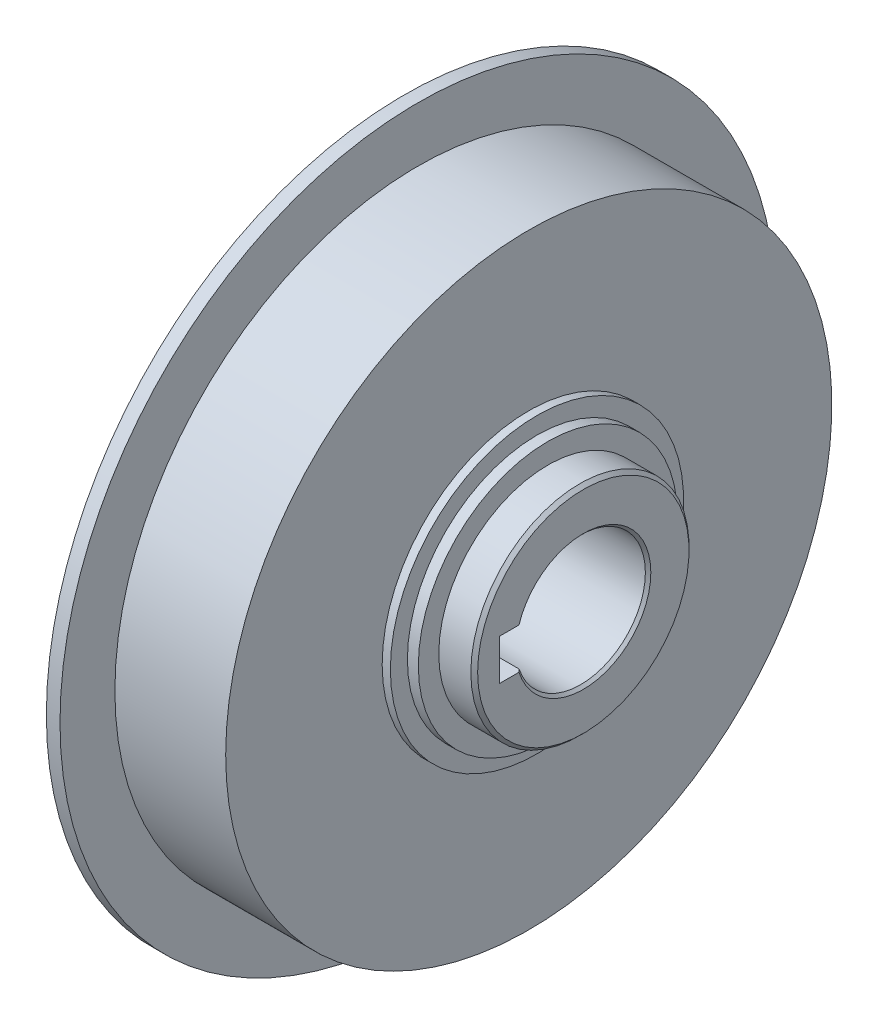
ISO-10303-21;
HEADER;
FILE_DESCRIPTION(('STEP AP214'),'2;1');
FILE_NAME('part.step','',(''),(''),'','','');
FILE_SCHEMA(('AUTOMOTIVE_DESIGN { 1 0 10303 214 1 1 1 1 }'));
ENDSEC;
DATA;
#1=APPLICATION_CONTEXT('core data for automotive mechanical design processes');
#2=APPLICATION_PROTOCOL_DEFINITION('international standard','automotive_design',2000,#1);
#3=PRODUCT_CONTEXT('',#1,'mechanical');
#4=PRODUCT('Part','Part','',(#3));
#5=PRODUCT_RELATED_PRODUCT_CATEGORY('part','',(#4));
#6=PRODUCT_DEFINITION_FORMATION('','',#4);
#7=PRODUCT_DEFINITION_CONTEXT('part definition',#1,'design');
#8=PRODUCT_DEFINITION('design','',#6,#7);
#9=PRODUCT_DEFINITION_SHAPE('','',#8);
#10=(LENGTH_UNIT() NAMED_UNIT(*) SI_UNIT(.MILLI.,.METRE.));
#11=(NAMED_UNIT(*) PLANE_ANGLE_UNIT() SI_UNIT($,.RADIAN.));
#12=(NAMED_UNIT(*) SI_UNIT($,.STERADIAN.) SOLID_ANGLE_UNIT());
#13=UNCERTAINTY_MEASURE_WITH_UNIT(LENGTH_MEASURE(1.E-05),#10,'distance_accuracy_value','');
#14=(GEOMETRIC_REPRESENTATION_CONTEXT(3) GLOBAL_UNCERTAINTY_ASSIGNED_CONTEXT((#13)) GLOBAL_UNIT_ASSIGNED_CONTEXT((#10,
#11,#12)) REPRESENTATION_CONTEXT('',''));
#15=CARTESIAN_POINT('',(0.,0.,0.));
#16=DIRECTION('',(0.,0.,1.));
#17=DIRECTION('',(1.,0.,0.));
#18=AXIS2_PLACEMENT_3D('',#15,#16,#17);
#19=CARTESIAN_POINT('',(64.1,0.,0.));
#20=DIRECTION('',(1.,0.,0.));
#21=DIRECTION('',(0.,0.,-1.));
#22=AXIS2_PLACEMENT_3D('',#19,#20,#21);
#23=CONICAL_SURFACE('',#22,9.89999999999999,0.785398163397453);
#24=CARTESIAN_POINT('',(63.7,0.,0.));
#25=DIRECTION('',(-1.,0.,0.));
#26=DIRECTION('',(0.,0.,1.));
#27=AXIS2_PLACEMENT_3D('',#24,#25,#26);
#28=CIRCLE('',#27,9.5);
#29=CARTESIAN_POINT('',(63.7,3.,9.01387818865997));
#30=VERTEX_POINT('',#29);
#31=CARTESIAN_POINT('',(63.7,-3.,9.01387818865997));
#32=VERTEX_POINT('',#31);
#33=EDGE_CURVE('E80',#30,#32,#28,.T.);
#34=ORIENTED_EDGE('',*,*,#33,.T.);
#35=CARTESIAN_POINT('',(64.1,-3.,9.43451111610983));
#36=CARTESIAN_POINT('',(64.0332569464257,-3.,9.36447826898815));
#37=CARTESIAN_POINT('',(63.9665520865089,-3.,9.29440910168789));
#38=CARTESIAN_POINT('',(63.8332187531747,-3.,9.15419812587216));
#39=CARTESIAN_POINT('',(63.7665902797581,-3.,9.0840563173558));
#40=CARTESIAN_POINT('',(63.7,-3.,9.01387818865998));
#41=B_SPLINE_CURVE_WITH_KNOTS('',3,(#35,#36,#37,#38,#39,#40),.UNSPECIFIED.,.F.,.F.,(4,2,4),(0.,
0.290229286744041,0.58045857704044),.UNSPECIFIED.);
#42=CARTESIAN_POINT('',(64.1,-3.,9.43451111610983));
#43=VERTEX_POINT('',#42);
#44=EDGE_CURVE('E75',#43,#32,#41,.T.);
#45=ORIENTED_EDGE('',*,*,#44,.F.);
#46=CARTESIAN_POINT('',(64.1,0.,0.));
#47=DIRECTION('',(1.,0.,0.));
#48=DIRECTION('',(0.,0.,-1.));
#49=AXIS2_PLACEMENT_3D('',#46,#47,#48);
#50=CIRCLE('',#49,9.89999999999999);
#51=CARTESIAN_POINT('',(64.1,3.,9.43451111610983));
#52=VERTEX_POINT('',#51);
#53=EDGE_CURVE('E73',#52,#43,#50,.F.);
#54=ORIENTED_EDGE('',*,*,#53,.F.);
#55=CARTESIAN_POINT('',(63.7,3.,9.01387818865998));
#56=CARTESIAN_POINT('',(63.7665902797581,3.,9.0840563173558));
#57=CARTESIAN_POINT('',(63.8332187531747,3.,9.15419812587216));
#58=CARTESIAN_POINT('',(63.9665520865089,3.,9.29440910168789));
#59=CARTESIAN_POINT('',(64.0332569464257,3.,9.36447826898815));
#60=CARTESIAN_POINT('',(64.1,3.,9.43451111610983));
#61=B_SPLINE_CURVE_WITH_KNOTS('',3,(#55,#56,#57,#58,#59,#60),.UNSPECIFIED.,.F.,.F.,(4,2,4),(0.,
0.290229290296408,0.580458577040441),.UNSPECIFIED.);
#62=EDGE_CURVE('E21',#30,#52,#61,.T.);
#63=ORIENTED_EDGE('',*,*,#62,.F.);
#64=EDGE_LOOP('',(#34,#45,#54,#63));
#65=FACE_BOUND('',#64,.T.);
#66=ADVANCED_FACE('F17',(#65),#23,.F.);
#67=CARTESIAN_POINT('',(46.7,0.,0.));
#68=DIRECTION('',(-1.,0.,0.));
#69=DIRECTION('',(0.,0.,1.));
#70=AXIS2_PLACEMENT_3D('',#67,#68,#69);
#71=CYLINDRICAL_SURFACE('',#70,9.5);
#72=ORIENTED_EDGE('',*,*,#33,.F.);
#73=DIRECTION('',(1.,0.,0.));
#74=VECTOR('',#73,1.);
#75=CARTESIAN_POINT('',(46.7,3.,9.01387818865997));
#76=LINE('',#75,#74);
#77=CARTESIAN_POINT('',(29.7,3.,9.01387818865997));
#78=VERTEX_POINT('',#77);
#79=EDGE_CURVE('E88',#78,#30,#76,.T.);
#80=ORIENTED_EDGE('',*,*,#79,.F.);
#81=CARTESIAN_POINT('',(29.7,0.,0.));
#82=DIRECTION('',(-1.,0.,0.));
#83=DIRECTION('',(0.,0.,1.));
#84=AXIS2_PLACEMENT_3D('',#81,#82,#83);
#85=CIRCLE('',#84,9.5);
#86=CARTESIAN_POINT('',(29.7,-3.,9.01387818865997));
#87=VERTEX_POINT('',#86);
#88=EDGE_CURVE('E94',#78,#87,#85,.T.);
#89=ORIENTED_EDGE('',*,*,#88,.T.);
#90=DIRECTION('',(1.,0.,0.));
#91=VECTOR('',#90,1.);
#92=CARTESIAN_POINT('',(46.7,-3.,9.01387818865997));
#93=LINE('',#92,#91);
#94=EDGE_CURVE('E79',#32,#87,#93,.F.);
#95=ORIENTED_EDGE('',*,*,#94,.F.);
#96=EDGE_LOOP('',(#72,#80,#89,#95));
#97=FACE_BOUND('',#96,.T.);
#98=ADVANCED_FACE('F308',(#97),#71,.F.);
#99=CARTESIAN_POINT('',(64.1,0.,12.7));
#100=DIRECTION('',(1.,0.,0.));
#101=DIRECTION('',(0.,0.,-1.));
#102=AXIS2_PLACEMENT_3D('',#99,#100,#101);
#103=PLANE('',#102);
#104=DIRECTION('',(0.,0.,-1.));
#105=VECTOR('',#104,1.);
#106=CARTESIAN_POINT('',(64.1,3.,6.15));
#107=LINE('',#106,#105);
#108=CARTESIAN_POINT('',(64.1,3.,12.3));
#109=VERTEX_POINT('',#108);
#110=EDGE_CURVE('E85',#52,#109,#107,.F.);
#111=ORIENTED_EDGE('',*,*,#110,.F.);
#112=ORIENTED_EDGE('',*,*,#53,.T.);
#113=DIRECTION('',(0.,0.,1.));
#114=VECTOR('',#113,1.);
#115=CARTESIAN_POINT('',(64.1,-3.,6.15));
#116=LINE('',#115,#114);
#117=CARTESIAN_POINT('',(64.1,-3.,12.3));
#118=VERTEX_POINT('',#117);
#119=EDGE_CURVE('E110',#118,#43,#116,.F.);
#120=ORIENTED_EDGE('',*,*,#119,.F.);
#121=DIRECTION('',(0.,1.,0.));
#122=VECTOR('',#121,1.);
#123=CARTESIAN_POINT('',(64.1,0.,12.3));
#124=LINE('',#123,#122);
#125=EDGE_CURVE('E92',#118,#109,#124,.T.);
#126=ORIENTED_EDGE('',*,*,#125,.T.);
#127=EDGE_LOOP('',(#111,#112,#120,#126));
#128=FACE_BOUND('',#127,.T.);
#129=CARTESIAN_POINT('',(64.1,0.,0.));
#130=DIRECTION('',(-1.,0.,0.));
#131=DIRECTION('',(0.,0.,1.));
#132=AXIS2_PLACEMENT_3D('',#129,#130,#131);
#133=CIRCLE('',#132,15.5);
#134=CARTESIAN_POINT('',(64.1,0.,15.5));
#135=VERTEX_POINT('',#134);
#136=EDGE_CURVE('E149',#135,#135,#133,.T.);
#137=ORIENTED_EDGE('',*,*,#136,.F.);
#138=EDGE_LOOP('',(#137));
#139=FACE_BOUND('',#138,.T.);
#140=ADVANCED_FACE('F89',(#128,#139),#103,.T.);
#141=CARTESIAN_POINT('',(46.7,-3.,6.15));
#142=DIRECTION('',(0.,1.,0.));
#143=DIRECTION('',(0.,0.,1.));
#144=AXIS2_PLACEMENT_3D('',#141,#142,#143);
#145=PLANE('',#144);
#146=DIRECTION('',(1.,0.,0.));
#147=VECTOR('',#146,1.);
#148=CARTESIAN_POINT('',(46.7,-3.,12.3));
#149=LINE('',#148,#147);
#150=CARTESIAN_POINT('',(29.3,-3.,12.3));
#151=VERTEX_POINT('',#150);
#152=EDGE_CURVE('E384',#151,#118,#149,.T.);
#153=ORIENTED_EDGE('',*,*,#152,.T.);
#154=ORIENTED_EDGE('',*,*,#119,.T.);
#155=ORIENTED_EDGE('',*,*,#44,.T.);
#156=ORIENTED_EDGE('',*,*,#94,.T.);
#157=CARTESIAN_POINT('',(29.7,-3.,9.01387818865997));
#158=CARTESIAN_POINT('',(29.6334097202419,-3.,9.0840563173558));
#159=CARTESIAN_POINT('',(29.5667812468253,-3.,9.15419812587216));
#160=CARTESIAN_POINT('',(29.4334479134911,-3.,9.29440910168789));
#161=CARTESIAN_POINT('',(29.3667430535743,-3.,9.36447826898815));
#162=CARTESIAN_POINT('',(29.3,-3.,9.43451111610984));
#163=B_SPLINE_CURVE_WITH_KNOTS('',3,(#157,#158,#159,#160,#161,#162),.UNSPECIFIED.,.F.,.F.,(4,2,
4),(0.,0.290229290296411,0.580458577040461),.UNSPECIFIED.);
#164=CARTESIAN_POINT('',(29.3,-3.,9.43451111610983));
#165=VERTEX_POINT('',#164);
#166=EDGE_CURVE('E97',#87,#165,#163,.T.);
#167=ORIENTED_EDGE('',*,*,#166,.T.);
#168=DIRECTION('',(0.,0.,1.));
#169=VECTOR('',#168,1.);
#170=CARTESIAN_POINT('',(29.3,-3.,24.325));
#171=LINE('',#170,#169);
#172=EDGE_CURVE('E148',#151,#165,#171,.F.);
#173=ORIENTED_EDGE('',*,*,#172,.F.);
#174=EDGE_LOOP('',(#153,#154,#155,#156,#167,#173));
#175=FACE_BOUND('',#174,.T.);
#176=ADVANCED_FACE('F295',(#175),#145,.T.);
#177=CARTESIAN_POINT('',(29.3,0.,0.));
#178=DIRECTION('',(-1.,0.,0.));
#179=DIRECTION('',(0.,-1.,0.));
#180=AXIS2_PLACEMENT_3D('',#177,#178,#179);
#181=CONICAL_SURFACE('',#180,9.90000000000001,0.78539816339745);
#182=ORIENTED_EDGE('',*,*,#88,.F.);
#183=CARTESIAN_POINT('',(29.3,3.,9.43451111610984));
#184=CARTESIAN_POINT('',(29.3667430535743,3.,9.36447826898815));
#185=CARTESIAN_POINT('',(29.4334479134911,3.,9.29440910168789));
#186=CARTESIAN_POINT('',(29.5667812468253,3.,9.15419812587216));
#187=CARTESIAN_POINT('',(29.6334097202419,3.,9.08405631735579));
#188=CARTESIAN_POINT('',(29.7,3.,9.01387818865997));
#189=B_SPLINE_CURVE_WITH_KNOTS('',3,(#183,#184,#185,#186,#187,#188),.UNSPECIFIED.,.F.,.F.,(4,2,
4),(0.,0.290229286744052,0.580458577040469),.UNSPECIFIED.);
#190=CARTESIAN_POINT('',(29.3,3.,9.43451111610984));
#191=VERTEX_POINT('',#190);
#192=EDGE_CURVE('E93',#191,#78,#189,.T.);
#193=ORIENTED_EDGE('',*,*,#192,.F.);
#194=CARTESIAN_POINT('',(29.3,0.,0.));
#195=DIRECTION('',(-1.,0.,0.));
#196=DIRECTION('',(0.,-1.,0.));
#197=AXIS2_PLACEMENT_3D('',#194,#195,#196);
#198=CIRCLE('',#197,9.9);
#199=EDGE_CURVE('E144',#165,#191,#198,.F.);
#200=ORIENTED_EDGE('',*,*,#199,.F.);
#201=ORIENTED_EDGE('',*,*,#166,.F.);
#202=EDGE_LOOP('',(#182,#193,#200,#201));
#203=FACE_BOUND('',#202,.T.);
#204=ADVANCED_FACE('F160',(#203),#181,.F.);
#205=CARTESIAN_POINT('',(46.7,3.,6.15));
#206=DIRECTION('',(0.,-1.,0.));
#207=DIRECTION('',(0.,0.,-1.));
#208=AXIS2_PLACEMENT_3D('',#205,#206,#207);
#209=PLANE('',#208);
#210=ORIENTED_EDGE('',*,*,#192,.T.);
#211=ORIENTED_EDGE('',*,*,#79,.T.);
#212=ORIENTED_EDGE('',*,*,#62,.T.);
#213=ORIENTED_EDGE('',*,*,#110,.T.);
#214=DIRECTION('',(1.,0.,0.));
#215=VECTOR('',#214,1.);
#216=CARTESIAN_POINT('',(46.7,3.,12.3));
#217=LINE('',#216,#215);
#218=CARTESIAN_POINT('',(29.3,3.,12.3));
#219=VERTEX_POINT('',#218);
#220=EDGE_CURVE('E40',#109,#219,#217,.F.);
#221=ORIENTED_EDGE('',*,*,#220,.T.);
#222=DIRECTION('',(0.,0.,1.));
#223=VECTOR('',#222,1.);
#224=CARTESIAN_POINT('',(29.3,3.,24.325));
#225=LINE('',#224,#223);
#226=EDGE_CURVE('E147',#191,#219,#225,.T.);
#227=ORIENTED_EDGE('',*,*,#226,.F.);
#228=EDGE_LOOP('',(#210,#211,#212,#213,#221,#227));
#229=FACE_BOUND('',#228,.T.);
#230=ADVANCED_FACE('F84',(#229),#209,.T.);
#231=CARTESIAN_POINT('',(46.7,0.,12.3));
#232=DIRECTION('',(0.,0.,1.));
#233=DIRECTION('',(1.,0.,0.));
#234=AXIS2_PLACEMENT_3D('',#231,#232,#233);
#235=PLANE('',#234);
#236=ORIENTED_EDGE('',*,*,#152,.F.);
#237=DIRECTION('',(0.,1.,0.));
#238=VECTOR('',#237,1.);
#239=CARTESIAN_POINT('',(29.3,0.,12.3));
#240=LINE('',#239,#238);
#241=EDGE_CURVE('E392',#219,#151,#240,.F.);
#242=ORIENTED_EDGE('',*,*,#241,.F.);
#243=ORIENTED_EDGE('',*,*,#220,.F.);
#244=ORIENTED_EDGE('',*,*,#125,.F.);
#245=EDGE_LOOP('',(#236,#242,#243,#244));
#246=FACE_BOUND('',#245,.T.);
#247=ADVANCED_FACE('F165',(#246),#235,.F.);
#248=CARTESIAN_POINT('',(63.6,0.,0.));
#249=DIRECTION('',(-1.,0.,0.));
#250=DIRECTION('',(0.,0.,1.));
#251=AXIS2_PLACEMENT_3D('',#248,#249,#250);
#252=CONICAL_SURFACE('',#251,16.,0.785398163397448);
#253=ORIENTED_EDGE('',*,*,#136,.T.);
#254=EDGE_LOOP('',(#253));
#255=FACE_BOUND('',#254,.T.);
#256=CARTESIAN_POINT('',(63.6,0.,0.));
#257=DIRECTION('',(-1.,0.,0.));
#258=DIRECTION('',(0.,0.,1.));
#259=AXIS2_PLACEMENT_3D('',#256,#257,#258);
#260=CIRCLE('',#259,16.);
#261=CARTESIAN_POINT('',(63.6,0.,16.));
#262=VERTEX_POINT('',#261);
#263=EDGE_CURVE('E143',#262,#262,#260,.T.);
#264=ORIENTED_EDGE('',*,*,#263,.F.);
#265=EDGE_LOOP('',(#264));
#266=FACE_BOUND('',#265,.T.);
#267=ADVANCED_FACE('F169',(#255,#266),#252,.T.);
#268=CARTESIAN_POINT('',(29.3,0.,24.325));
#269=DIRECTION('',(-1.,0.,0.));
#270=DIRECTION('',(0.,0.,1.));
#271=AXIS2_PLACEMENT_3D('',#268,#269,#270);
#272=PLANE('',#271);
#273=CARTESIAN_POINT('',(29.3,0.,0.));
#274=DIRECTION('',(-1.,0.,0.));
#275=DIRECTION('',(0.,0.,1.));
#276=AXIS2_PLACEMENT_3D('',#273,#274,#275);
#277=CIRCLE('',#276,38.75);
#278=CARTESIAN_POINT('',(29.3,0.,38.75));
#279=VERTEX_POINT('',#278);
#280=EDGE_CURVE('E140',#279,#279,#277,.F.);
#281=ORIENTED_EDGE('',*,*,#280,.F.);
#282=EDGE_LOOP('',(#281));
#283=FACE_BOUND('',#282,.T.);
#284=ORIENTED_EDGE('',*,*,#226,.T.);
#285=ORIENTED_EDGE('',*,*,#241,.T.);
#286=ORIENTED_EDGE('',*,*,#172,.T.);
#287=ORIENTED_EDGE('',*,*,#199,.T.);
#288=EDGE_LOOP('',(#284,#285,#286,#287));
#289=FACE_BOUND('',#288,.T.);
#290=ADVANCED_FACE('F173',(#283,#289),#272,.T.);
#291=CARTESIAN_POINT('',(61.25,0.,0.));
#292=DIRECTION('',(-1.,0.,0.));
#293=DIRECTION('',(0.,0.,1.));
#294=AXIS2_PLACEMENT_3D('',#291,#292,#293);
#295=CYLINDRICAL_SURFACE('',#294,16.);
#296=ORIENTED_EDGE('',*,*,#263,.T.);
#297=EDGE_LOOP('',(#296));
#298=FACE_BOUND('',#297,.T.);
#299=CARTESIAN_POINT('',(58.9,0.,0.));
#300=DIRECTION('',(-1.,0.,0.));
#301=DIRECTION('',(0.,0.,1.));
#302=AXIS2_PLACEMENT_3D('',#299,#300,#301);
#303=CIRCLE('',#302,16.);
#304=CARTESIAN_POINT('',(58.9,0.,16.));
#305=VERTEX_POINT('',#304);
#306=EDGE_CURVE('E137',#305,#305,#303,.T.);
#307=ORIENTED_EDGE('',*,*,#306,.F.);
#308=EDGE_LOOP('',(#307));
#309=FACE_BOUND('',#308,.T.);
#310=ADVANCED_FACE('F177',(#298,#309),#295,.T.);
#311=CARTESIAN_POINT('',(33.575,0.,0.));
#312=DIRECTION('',(-1.,0.,0.));
#313=DIRECTION('',(0.,0.,1.));
#314=AXIS2_PLACEMENT_3D('',#311,#312,#313);
#315=CYLINDRICAL_SURFACE('',#314,38.75);
#316=CARTESIAN_POINT('',(37.85,0.,0.));
#317=DIRECTION('',(-1.,0.,0.));
#318=DIRECTION('',(0.,0.,1.));
#319=AXIS2_PLACEMENT_3D('',#316,#317,#318);
#320=CIRCLE('',#319,38.75);
#321=CARTESIAN_POINT('',(37.85,0.,38.75));
#322=VERTEX_POINT('',#321);
#323=EDGE_CURVE('E134',#322,#322,#320,.F.);
#324=ORIENTED_EDGE('',*,*,#323,.F.);
#325=EDGE_LOOP('',(#324));
#326=FACE_BOUND('',#325,.T.);
#327=ORIENTED_EDGE('',*,*,#280,.T.);
#328=EDGE_LOOP('',(#327));
#329=FACE_BOUND('',#328,.T.);
#330=ADVANCED_FACE('F181',(#326,#329),#315,.T.);
#331=CARTESIAN_POINT('',(58.9,0.,17.5));
#332=DIRECTION('',(1.,0.,0.));
#333=DIRECTION('',(0.,0.,-1.));
#334=AXIS2_PLACEMENT_3D('',#331,#332,#333);
#335=PLANE('',#334);
#336=CARTESIAN_POINT('',(58.9,0.,0.));
#337=DIRECTION('',(-1.,0.,0.));
#338=DIRECTION('',(0.,0.,1.));
#339=AXIS2_PLACEMENT_3D('',#336,#337,#338);
#340=CIRCLE('',#339,19.);
#341=CARTESIAN_POINT('',(58.9,0.,19.));
#342=VERTEX_POINT('',#341);
#343=EDGE_CURVE('E131',#342,#342,#340,.T.);
#344=ORIENTED_EDGE('',*,*,#343,.F.);
#345=EDGE_LOOP('',(#344));
#346=FACE_BOUND('',#345,.T.);
#347=ORIENTED_EDGE('',*,*,#306,.T.);
#348=EDGE_LOOP('',(#347));
#349=FACE_BOUND('',#348,.T.);
#350=ADVANCED_FACE('F185',(#346,#349),#335,.T.);
#351=CARTESIAN_POINT('',(37.85,0.,45.625));
#352=DIRECTION('',(-1.,0.,0.));
#353=DIRECTION('',(0.,0.,1.));
#354=AXIS2_PLACEMENT_3D('',#351,#352,#353);
#355=PLANE('',#354);
#356=ORIENTED_EDGE('',*,*,#323,.T.);
#357=EDGE_LOOP('',(#356));
#358=FACE_BOUND('',#357,.T.);
#359=CARTESIAN_POINT('',(37.85,0.,0.));
#360=DIRECTION('',(-1.,0.,0.));
#361=DIRECTION('',(0.,0.,1.));
#362=AXIS2_PLACEMENT_3D('',#359,#360,#361);
#363=CIRCLE('',#362,52.5);
#364=CARTESIAN_POINT('',(37.85,0.,52.5));
#365=VERTEX_POINT('',#364);
#366=EDGE_CURVE('E128',#365,#365,#363,.F.);
#367=ORIENTED_EDGE('',*,*,#366,.F.);
#368=EDGE_LOOP('',(#367));
#369=FACE_BOUND('',#368,.T.);
#370=ADVANCED_FACE('F189',(#358,#369),#355,.T.);
#371=CARTESIAN_POINT('',(58.1,0.,0.));
#372=DIRECTION('',(-1.,0.,0.));
#373=DIRECTION('',(0.,0.,1.));
#374=AXIS2_PLACEMENT_3D('',#371,#372,#373);
#375=CYLINDRICAL_SURFACE('',#374,19.);
#376=ORIENTED_EDGE('',*,*,#343,.T.);
#377=EDGE_LOOP('',(#376));
#378=FACE_BOUND('',#377,.T.);
#379=CARTESIAN_POINT('',(57.3,0.,0.));
#380=DIRECTION('',(-1.,0.,0.));
#381=DIRECTION('',(0.,0.,1.));
#382=AXIS2_PLACEMENT_3D('',#379,#380,#381);
#383=CIRCLE('',#382,19.);
#384=CARTESIAN_POINT('',(57.3,0.,19.));
#385=VERTEX_POINT('',#384);
#386=EDGE_CURVE('E125',#385,#385,#383,.T.);
#387=ORIENTED_EDGE('',*,*,#386,.F.);
#388=EDGE_LOOP('',(#387));
#389=FACE_BOUND('',#388,.T.);
#390=ADVANCED_FACE('F193',(#378,#389),#375,.T.);
#391=CARTESIAN_POINT('',(38.85,0.,0.));
#392=DIRECTION('',(-1.,0.,0.));
#393=DIRECTION('',(0.,0.,1.));
#394=AXIS2_PLACEMENT_3D('',#391,#392,#393);
#395=CYLINDRICAL_SURFACE('',#394,52.5);
#396=CARTESIAN_POINT('',(39.85,0.,0.));
#397=DIRECTION('',(-1.,0.,0.));
#398=DIRECTION('',(0.,0.,1.));
#399=AXIS2_PLACEMENT_3D('',#396,#397,#398);
#400=CIRCLE('',#399,52.5);
#401=CARTESIAN_POINT('',(39.85,0.,52.5));
#402=VERTEX_POINT('',#401);
#403=EDGE_CURVE('E122',#402,#402,#400,.F.);
#404=ORIENTED_EDGE('',*,*,#403,.F.);
#405=EDGE_LOOP('',(#404));
#406=FACE_BOUND('',#405,.T.);
#407=ORIENTED_EDGE('',*,*,#366,.T.);
#408=EDGE_LOOP('',(#407));
#409=FACE_BOUND('',#408,.T.);
#410=ADVANCED_FACE('F197',(#406,#409),#395,.T.);
#411=CARTESIAN_POINT('',(57.3,0.,20.25));
#412=DIRECTION('',(1.,0.,0.));
#413=DIRECTION('',(0.,0.,-1.));
#414=AXIS2_PLACEMENT_3D('',#411,#412,#413);
#415=PLANE('',#414);
#416=CARTESIAN_POINT('',(57.3,0.,0.));
#417=DIRECTION('',(-1.,0.,0.));
#418=DIRECTION('',(0.,0.,1.));
#419=AXIS2_PLACEMENT_3D('',#416,#417,#418);
#420=CIRCLE('',#419,21.5);
#421=CARTESIAN_POINT('',(57.3,0.,21.5));
#422=VERTEX_POINT('',#421);
#423=EDGE_CURVE('E119',#422,#422,#420,.T.);
#424=ORIENTED_EDGE('',*,*,#423,.F.);
#425=EDGE_LOOP('',(#424));
#426=FACE_BOUND('',#425,.T.);
#427=ORIENTED_EDGE('',*,*,#386,.T.);
#428=EDGE_LOOP('',(#427));
#429=FACE_BOUND('',#428,.T.);
#430=ADVANCED_FACE('F201',(#426,#429),#415,.T.);
#431=CARTESIAN_POINT('',(39.85,0.,48.475));
#432=DIRECTION('',(1.,0.,0.));
#433=DIRECTION('',(0.,0.,-1.));
#434=AXIS2_PLACEMENT_3D('',#431,#432,#433);
#435=PLANE('',#434);
#436=ORIENTED_EDGE('',*,*,#403,.T.);
#437=EDGE_LOOP('',(#436));
#438=FACE_BOUND('',#437,.T.);
#439=CARTESIAN_POINT('',(39.85,0.,0.));
#440=DIRECTION('',(-1.,0.,0.));
#441=DIRECTION('',(0.,0.,1.));
#442=AXIS2_PLACEMENT_3D('',#439,#440,#441);
#443=CIRCLE('',#442,44.45);
#444=CARTESIAN_POINT('',(39.85,0.,44.45));
#445=VERTEX_POINT('',#444);
#446=EDGE_CURVE('E116',#445,#445,#443,.F.);
#447=ORIENTED_EDGE('',*,*,#446,.F.);
#448=EDGE_LOOP('',(#447));
#449=FACE_BOUND('',#448,.T.);
#450=ADVANCED_FACE('F205',(#438,#449),#435,.T.);
#451=CARTESIAN_POINT('',(56.7,0.,0.));
#452=DIRECTION('',(-1.,0.,0.));
#453=DIRECTION('',(0.,0.,1.));
#454=AXIS2_PLACEMENT_3D('',#451,#452,#453);
#455=CYLINDRICAL_SURFACE('',#454,21.5);
#456=ORIENTED_EDGE('',*,*,#423,.T.);
#457=EDGE_LOOP('',(#456));
#458=FACE_BOUND('',#457,.T.);
#459=CARTESIAN_POINT('',(56.1,0.,0.));
#460=DIRECTION('',(-1.,0.,0.));
#461=DIRECTION('',(0.,0.,1.));
#462=AXIS2_PLACEMENT_3D('',#459,#460,#461);
#463=CIRCLE('',#462,21.5);
#464=CARTESIAN_POINT('',(56.1,0.,21.5));
#465=VERTEX_POINT('',#464);
#466=EDGE_CURVE('E31',#465,#465,#463,.T.);
#467=ORIENTED_EDGE('',*,*,#466,.F.);
#468=EDGE_LOOP('',(#467));
#469=FACE_BOUND('',#468,.T.);
#470=ADVANCED_FACE('F209',(#458,#469),#455,.T.);
#471=CARTESIAN_POINT('',(47.975,0.,0.));
#472=DIRECTION('',(-1.,0.,0.));
#473=DIRECTION('',(0.,0.,1.));
#474=AXIS2_PLACEMENT_3D('',#471,#472,#473);
#475=CYLINDRICAL_SURFACE('',#474,44.45);
#476=CARTESIAN_POINT('',(56.1,0.,0.));
#477=DIRECTION('',(-1.,0.,0.));
#478=DIRECTION('',(0.,0.,1.));
#479=AXIS2_PLACEMENT_3D('',#476,#477,#478);
#480=CIRCLE('',#479,44.45);
#481=CARTESIAN_POINT('',(56.1,0.,44.45));
#482=VERTEX_POINT('',#481);
#483=EDGE_CURVE('E11',#482,#482,#480,.F.);
#484=ORIENTED_EDGE('',*,*,#483,.F.);
#485=EDGE_LOOP('',(#484));
#486=FACE_BOUND('',#485,.T.);
#487=ORIENTED_EDGE('',*,*,#446,.T.);
#488=EDGE_LOOP('',(#487));
#489=FACE_BOUND('',#488,.T.);
#490=ADVANCED_FACE('F213',(#486,#489),#475,.T.);
#491=CARTESIAN_POINT('',(56.1,0.,32.975));
#492=DIRECTION('',(1.,0.,0.));
#493=DIRECTION('',(0.,0.,-1.));
#494=AXIS2_PLACEMENT_3D('',#491,#492,#493);
#495=PLANE('',#494);
#496=ORIENTED_EDGE('',*,*,#483,.T.);
#497=EDGE_LOOP('',(#496));
#498=FACE_BOUND('',#497,.T.);
#499=ORIENTED_EDGE('',*,*,#466,.T.);
#500=EDGE_LOOP('',(#499));
#501=FACE_BOUND('',#500,.T.);
#502=ADVANCED_FACE('F217',(#498,#501),#495,.T.);
#503=CLOSED_SHELL('',(#66,#98,#140,#176,#204,#230,#247,#267,#290,#310,#330,#350,#370,#390,#410,
#430,#450,#470,#490,#502));
#504=MANIFOLD_SOLID_BREP('B1',#503);
#505=ADVANCED_BREP_SHAPE_REPRESENTATION('',(#18,#504),#14);
#506=SHAPE_DEFINITION_REPRESENTATION(#9,#505);
ENDSEC;
END-ISO-10303-21;
